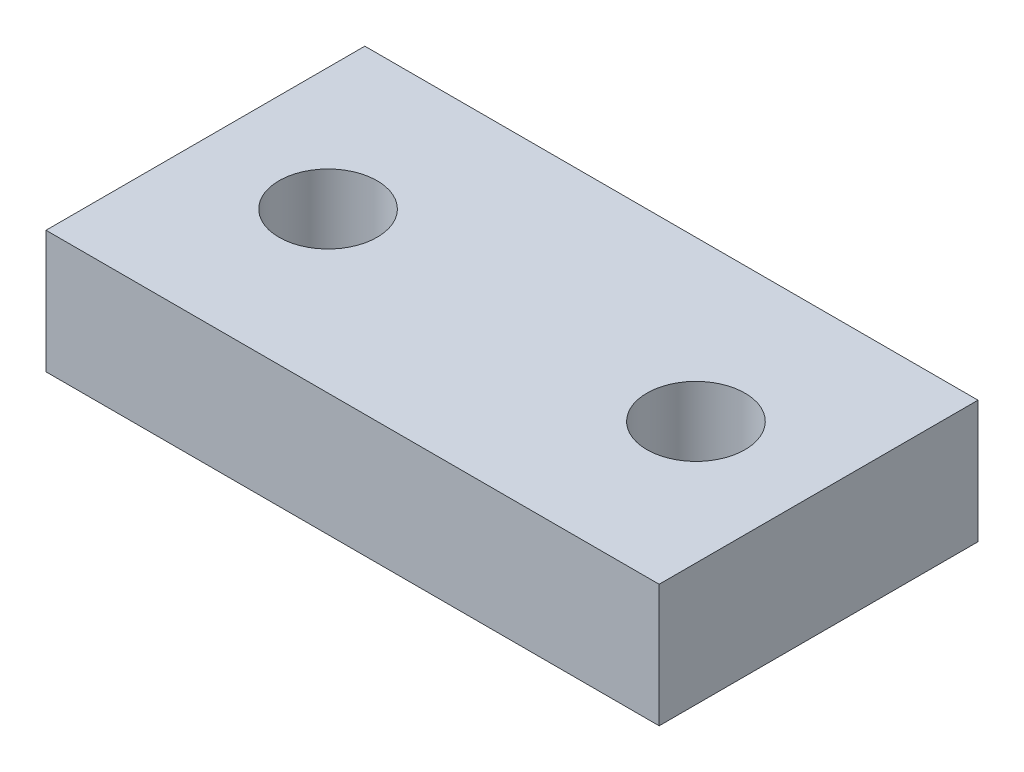
ISO-10303-21;
HEADER;
FILE_DESCRIPTION(('STEP AP214'),'2;1');
FILE_NAME('part.step','',(''),(''),'','','');
FILE_SCHEMA(('AUTOMOTIVE_DESIGN { 1 0 10303 214 1 1 1 1 }'));
ENDSEC;
DATA;
#1=APPLICATION_CONTEXT('core data for automotive mechanical design processes');
#2=APPLICATION_PROTOCOL_DEFINITION('international standard','automotive_design',2000,#1);
#3=PRODUCT_CONTEXT('',#1,'mechanical');
#4=PRODUCT('Part','Part','',(#3));
#5=PRODUCT_RELATED_PRODUCT_CATEGORY('part','',(#4));
#6=PRODUCT_DEFINITION_FORMATION('','',#4);
#7=PRODUCT_DEFINITION_CONTEXT('part definition',#1,'design');
#8=PRODUCT_DEFINITION('design','',#6,#7);
#9=PRODUCT_DEFINITION_SHAPE('','',#8);
#10=(LENGTH_UNIT() NAMED_UNIT(*) SI_UNIT(.MILLI.,.METRE.));
#11=(NAMED_UNIT(*) PLANE_ANGLE_UNIT() SI_UNIT($,.RADIAN.));
#12=(NAMED_UNIT(*) SI_UNIT($,.STERADIAN.) SOLID_ANGLE_UNIT());
#13=UNCERTAINTY_MEASURE_WITH_UNIT(LENGTH_MEASURE(1.E-05),#10,'distance_accuracy_value','');
#14=(GEOMETRIC_REPRESENTATION_CONTEXT(3) GLOBAL_UNCERTAINTY_ASSIGNED_CONTEXT((#13)) GLOBAL_UNIT_ASSIGNED_CONTEXT((#10,
#11,#12)) REPRESENTATION_CONTEXT('',''));
#15=CARTESIAN_POINT('',(0.,0.,0.));
#16=DIRECTION('',(0.,0.,1.));
#17=DIRECTION('',(1.,0.,0.));
#18=AXIS2_PLACEMENT_3D('',#15,#16,#17);
#19=CARTESIAN_POINT('',(0.,5.,0.));
#20=DIRECTION('',(0.,1.,0.));
#21=DIRECTION('',(0.,0.,1.));
#22=AXIS2_PLACEMENT_3D('',#19,#20,#21);
#23=PLANE('',#22);
#24=CARTESIAN_POINT('',(-7.5,5.,0.));
#25=DIRECTION('',(0.,1.,0.));
#26=DIRECTION('',(0.,0.,1.));
#27=AXIS2_PLACEMENT_3D('',#24,#25,#26);
#28=CIRCLE('',#27,2.);
#29=CARTESIAN_POINT('',(-7.5,5.,2.));
#30=VERTEX_POINT('',#29);
#31=EDGE_CURVE('E101',#30,#30,#28,.T.);
#32=ORIENTED_EDGE('',*,*,#31,.F.);
#33=EDGE_LOOP('',(#32));
#34=FACE_BOUND('',#33,.T.);
#35=DIRECTION('',(0.,0.,-1.));
#36=VECTOR('',#35,1.);
#37=CARTESIAN_POINT('',(12.5,5.,-6.5));
#38=LINE('',#37,#36);
#39=CARTESIAN_POINT('',(12.5,5.,6.5));
#40=VERTEX_POINT('',#39);
#41=CARTESIAN_POINT('',(12.5,5.,-6.5));
#42=VERTEX_POINT('',#41);
#43=EDGE_CURVE('E86',#40,#42,#38,.T.);
#44=ORIENTED_EDGE('',*,*,#43,.T.);
#45=DIRECTION('',(-1.,0.,0.));
#46=VECTOR('',#45,1.);
#47=CARTESIAN_POINT('',(-12.5,5.,-6.5));
#48=LINE('',#47,#46);
#49=CARTESIAN_POINT('',(-12.5,5.,-6.5));
#50=VERTEX_POINT('',#49);
#51=EDGE_CURVE('E81',#42,#50,#48,.T.);
#52=ORIENTED_EDGE('',*,*,#51,.T.);
#53=DIRECTION('',(0.,0.,1.));
#54=VECTOR('',#53,1.);
#55=CARTESIAN_POINT('',(-12.5,5.,-6.5));
#56=LINE('',#55,#54);
#57=CARTESIAN_POINT('',(-12.5,5.,6.5));
#58=VERTEX_POINT('',#57);
#59=EDGE_CURVE('E84',#50,#58,#56,.T.);
#60=ORIENTED_EDGE('',*,*,#59,.T.);
#61=DIRECTION('',(1.,0.,0.));
#62=VECTOR('',#61,1.);
#63=CARTESIAN_POINT('',(-12.5,5.,6.5));
#64=LINE('',#63,#62);
#65=EDGE_CURVE('E51',#58,#40,#64,.T.);
#66=ORIENTED_EDGE('',*,*,#65,.T.);
#67=EDGE_LOOP('',(#44,#52,#60,#66));
#68=FACE_BOUND('',#67,.T.);
#69=CARTESIAN_POINT('',(7.5,5.,0.));
#70=DIRECTION('',(0.,1.,0.));
#71=DIRECTION('',(0.,0.,1.));
#72=AXIS2_PLACEMENT_3D('',#69,#70,#71);
#73=CIRCLE('',#72,2.);
#74=CARTESIAN_POINT('',(7.5,5.,2.));
#75=VERTEX_POINT('',#74);
#76=EDGE_CURVE('E116',#75,#75,#73,.T.);
#77=ORIENTED_EDGE('',*,*,#76,.F.);
#78=EDGE_LOOP('',(#77));
#79=FACE_BOUND('',#78,.T.);
#80=ADVANCED_FACE('F34',(#34,#68,#79),#23,.T.);
#81=CARTESIAN_POINT('',(0.,0.,0.));
#82=DIRECTION('',(0.,1.,0.));
#83=DIRECTION('',(0.,0.,1.));
#84=AXIS2_PLACEMENT_3D('',#81,#82,#83);
#85=PLANE('',#84);
#86=DIRECTION('',(0.,0.,-1.));
#87=VECTOR('',#86,1.);
#88=CARTESIAN_POINT('',(12.5,0.,-6.5));
#89=LINE('',#88,#87);
#90=CARTESIAN_POINT('',(12.5,0.,6.5));
#91=VERTEX_POINT('',#90);
#92=CARTESIAN_POINT('',(12.5,0.,-6.5));
#93=VERTEX_POINT('',#92);
#94=EDGE_CURVE('E98',#91,#93,#89,.T.);
#95=ORIENTED_EDGE('',*,*,#94,.F.);
#96=DIRECTION('',(1.,0.,0.));
#97=VECTOR('',#96,1.);
#98=CARTESIAN_POINT('',(-12.5,0.,6.5));
#99=LINE('',#98,#97);
#100=CARTESIAN_POINT('',(-12.5,0.,6.5));
#101=VERTEX_POINT('',#100);
#102=EDGE_CURVE('E74',#101,#91,#99,.T.);
#103=ORIENTED_EDGE('',*,*,#102,.F.);
#104=DIRECTION('',(0.,0.,1.));
#105=VECTOR('',#104,1.);
#106=CARTESIAN_POINT('',(-12.5,0.,-6.5));
#107=LINE('',#106,#105);
#108=CARTESIAN_POINT('',(-12.5,0.,-6.5));
#109=VERTEX_POINT('',#108);
#110=EDGE_CURVE('E68',#109,#101,#107,.T.);
#111=ORIENTED_EDGE('',*,*,#110,.F.);
#112=DIRECTION('',(-1.,0.,0.));
#113=VECTOR('',#112,1.);
#114=CARTESIAN_POINT('',(-12.5,0.,-6.5));
#115=LINE('',#114,#113);
#116=EDGE_CURVE('E90',#93,#109,#115,.T.);
#117=ORIENTED_EDGE('',*,*,#116,.F.);
#118=EDGE_LOOP('',(#95,#103,#111,#117));
#119=FACE_BOUND('',#118,.T.);
#120=CARTESIAN_POINT('',(-7.5,0.,0.));
#121=DIRECTION('',(0.,1.,0.));
#122=DIRECTION('',(0.,0.,1.));
#123=AXIS2_PLACEMENT_3D('',#120,#121,#122);
#124=CIRCLE('',#123,2.);
#125=CARTESIAN_POINT('',(-7.5,0.,2.));
#126=VERTEX_POINT('',#125);
#127=EDGE_CURVE('E113',#126,#126,#124,.T.);
#128=ORIENTED_EDGE('',*,*,#127,.T.);
#129=EDGE_LOOP('',(#128));
#130=FACE_BOUND('',#129,.T.);
#131=CARTESIAN_POINT('',(7.5,0.,0.));
#132=DIRECTION('',(0.,1.,0.));
#133=DIRECTION('',(0.,0.,1.));
#134=AXIS2_PLACEMENT_3D('',#131,#132,#133);
#135=CIRCLE('',#134,2.);
#136=CARTESIAN_POINT('',(7.5,0.,2.));
#137=VERTEX_POINT('',#136);
#138=EDGE_CURVE('E119',#137,#137,#135,.T.);
#139=ORIENTED_EDGE('',*,*,#138,.T.);
#140=EDGE_LOOP('',(#139));
#141=FACE_BOUND('',#140,.T.);
#142=ADVANCED_FACE('F109',(#119,#130,#141),#85,.F.);
#143=CARTESIAN_POINT('',(12.5,5.,-6.5));
#144=DIRECTION('',(-1.,0.,0.));
#145=DIRECTION('',(0.,0.,1.));
#146=AXIS2_PLACEMENT_3D('',#143,#144,#145);
#147=PLANE('',#146);
#148=ORIENTED_EDGE('',*,*,#94,.T.);
#149=DIRECTION('',(0.,-1.,0.));
#150=VECTOR('',#149,1.);
#151=CARTESIAN_POINT('',(12.5,5.,-6.5));
#152=LINE('',#151,#150);
#153=EDGE_CURVE('E11',#42,#93,#152,.T.);
#154=ORIENTED_EDGE('',*,*,#153,.F.);
#155=ORIENTED_EDGE('',*,*,#43,.F.);
#156=DIRECTION('',(0.,-1.,0.));
#157=VECTOR('',#156,1.);
#158=CARTESIAN_POINT('',(12.5,5.,6.5));
#159=LINE('',#158,#157);
#160=EDGE_CURVE('E94',#40,#91,#159,.T.);
#161=ORIENTED_EDGE('',*,*,#160,.T.);
#162=EDGE_LOOP('',(#148,#154,#155,#161));
#163=FACE_BOUND('',#162,.T.);
#164=ADVANCED_FACE('F36',(#163),#147,.F.);
#165=CARTESIAN_POINT('',(-12.5,5.,-6.5));
#166=DIRECTION('',(0.,0.,1.));
#167=DIRECTION('',(1.,0.,0.));
#168=AXIS2_PLACEMENT_3D('',#165,#166,#167);
#169=PLANE('',#168);
#170=ORIENTED_EDGE('',*,*,#116,.T.);
#171=DIRECTION('',(0.,-1.,0.));
#172=VECTOR('',#171,1.);
#173=CARTESIAN_POINT('',(-12.5,5.,-6.5));
#174=LINE('',#173,#172);
#175=EDGE_CURVE('E43',#50,#109,#174,.T.);
#176=ORIENTED_EDGE('',*,*,#175,.F.);
#177=ORIENTED_EDGE('',*,*,#51,.F.);
#178=ORIENTED_EDGE('',*,*,#153,.T.);
#179=EDGE_LOOP('',(#170,#176,#177,#178));
#180=FACE_BOUND('',#179,.T.);
#181=ADVANCED_FACE('F89',(#180),#169,.F.);
#182=CARTESIAN_POINT('',(-12.5,5.,-6.5));
#183=DIRECTION('',(1.,0.,0.));
#184=DIRECTION('',(0.,0.,-1.));
#185=AXIS2_PLACEMENT_3D('',#182,#183,#184);
#186=PLANE('',#185);
#187=ORIENTED_EDGE('',*,*,#110,.T.);
#188=DIRECTION('',(0.,-1.,0.));
#189=VECTOR('',#188,1.);
#190=CARTESIAN_POINT('',(-12.5,5.,6.5));
#191=LINE('',#190,#189);
#192=EDGE_CURVE('E91',#58,#101,#191,.T.);
#193=ORIENTED_EDGE('',*,*,#192,.F.);
#194=ORIENTED_EDGE('',*,*,#59,.F.);
#195=ORIENTED_EDGE('',*,*,#175,.T.);
#196=EDGE_LOOP('',(#187,#193,#194,#195));
#197=FACE_BOUND('',#196,.T.);
#198=ADVANCED_FACE('F92',(#197),#186,.F.);
#199=CARTESIAN_POINT('',(-12.5,5.,6.5));
#200=DIRECTION('',(0.,0.,-1.));
#201=DIRECTION('',(-1.,0.,0.));
#202=AXIS2_PLACEMENT_3D('',#199,#200,#201);
#203=PLANE('',#202);
#204=ORIENTED_EDGE('',*,*,#102,.T.);
#205=ORIENTED_EDGE('',*,*,#160,.F.);
#206=ORIENTED_EDGE('',*,*,#65,.F.);
#207=ORIENTED_EDGE('',*,*,#192,.T.);
#208=EDGE_LOOP('',(#204,#205,#206,#207));
#209=FACE_BOUND('',#208,.T.);
#210=ADVANCED_FACE('F106',(#209),#203,.F.);
#211=CARTESIAN_POINT('',(-7.5,5.,0.));
#212=DIRECTION('',(0.,-1.,0.));
#213=DIRECTION('',(0.,0.,-1.));
#214=AXIS2_PLACEMENT_3D('',#211,#212,#213);
#215=CYLINDRICAL_SURFACE('',#214,2.);
#216=ORIENTED_EDGE('',*,*,#31,.T.);
#217=EDGE_LOOP('',(#216));
#218=FACE_BOUND('',#217,.T.);
#219=ORIENTED_EDGE('',*,*,#127,.F.);
#220=EDGE_LOOP('',(#219));
#221=FACE_BOUND('',#220,.T.);
#222=ADVANCED_FACE('F136',(#218,#221),#215,.F.);
#223=CARTESIAN_POINT('',(7.5,5.,0.));
#224=DIRECTION('',(0.,-1.,0.));
#225=DIRECTION('',(0.,0.,-1.));
#226=AXIS2_PLACEMENT_3D('',#223,#224,#225);
#227=CYLINDRICAL_SURFACE('',#226,2.);
#228=ORIENTED_EDGE('',*,*,#76,.T.);
#229=EDGE_LOOP('',(#228));
#230=FACE_BOUND('',#229,.T.);
#231=ORIENTED_EDGE('',*,*,#138,.F.);
#232=EDGE_LOOP('',(#231));
#233=FACE_BOUND('',#232,.T.);
#234=ADVANCED_FACE('F125',(#230,#233),#227,.F.);
#235=CLOSED_SHELL('',(#80,#142,#164,#181,#198,#210,#222,#234));
#236=MANIFOLD_SOLID_BREP('B2',#235);
#237=ADVANCED_BREP_SHAPE_REPRESENTATION('',(#18,#236),#14);
#238=SHAPE_DEFINITION_REPRESENTATION(#9,#237);
ENDSEC;
END-ISO-10303-21;
